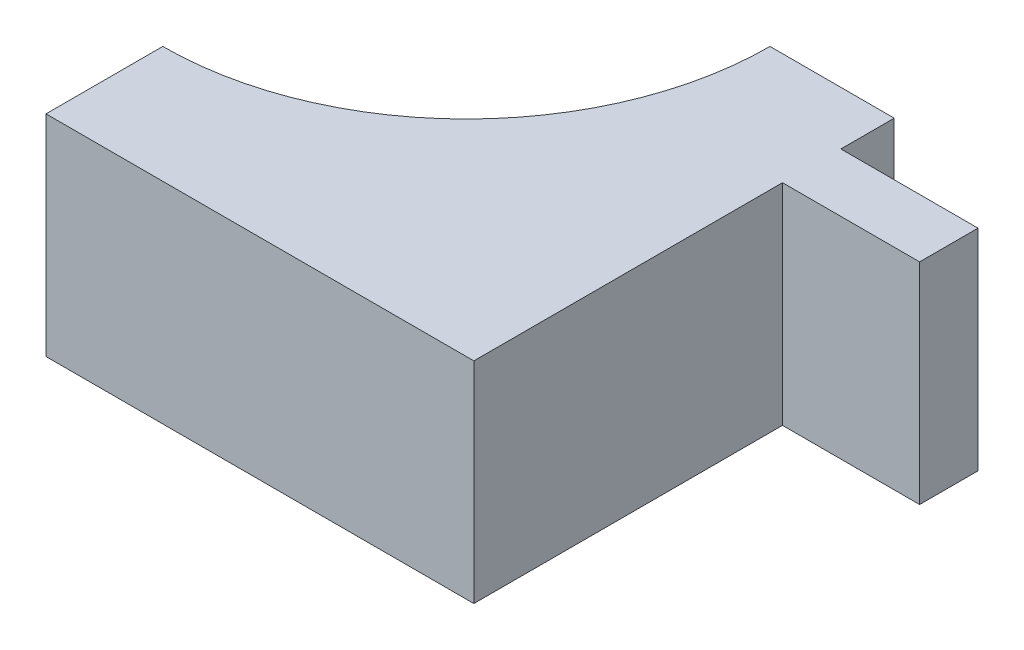
ISO-10303-21;
HEADER;
FILE_DESCRIPTION(('STEP AP214'),'2;1');
FILE_NAME('part.step','',(''),(''),'','','');
FILE_SCHEMA(('AUTOMOTIVE_DESIGN { 1 0 10303 214 1 1 1 1 }'));
ENDSEC;
DATA;
#1=APPLICATION_CONTEXT('core data for automotive mechanical design processes');
#2=APPLICATION_PROTOCOL_DEFINITION('international standard','automotive_design',2000,#1);
#3=PRODUCT_CONTEXT('',#1,'mechanical');
#4=PRODUCT('Part','Part','',(#3));
#5=PRODUCT_RELATED_PRODUCT_CATEGORY('part','',(#4));
#6=PRODUCT_DEFINITION_FORMATION('','',#4);
#7=PRODUCT_DEFINITION_CONTEXT('part definition',#1,'design');
#8=PRODUCT_DEFINITION('design','',#6,#7);
#9=PRODUCT_DEFINITION_SHAPE('','',#8);
#10=(LENGTH_UNIT() NAMED_UNIT(*) SI_UNIT(.MILLI.,.METRE.));
#11=(NAMED_UNIT(*) PLANE_ANGLE_UNIT() SI_UNIT($,.RADIAN.));
#12=(NAMED_UNIT(*) SI_UNIT($,.STERADIAN.) SOLID_ANGLE_UNIT());
#13=UNCERTAINTY_MEASURE_WITH_UNIT(LENGTH_MEASURE(1.E-05),#10,'distance_accuracy_value','');
#14=(GEOMETRIC_REPRESENTATION_CONTEXT(3) GLOBAL_UNCERTAINTY_ASSIGNED_CONTEXT((#13)) GLOBAL_UNIT_ASSIGNED_CONTEXT((#10,
#11,#12)) REPRESENTATION_CONTEXT('',''));
#15=CARTESIAN_POINT('',(0.,0.,0.));
#16=DIRECTION('',(0.,0.,1.));
#17=DIRECTION('',(1.,0.,0.));
#18=AXIS2_PLACEMENT_3D('',#15,#16,#17);
#19=CARTESIAN_POINT('',(-50.,18.,-305.));
#20=DIRECTION('',(0.,-1.,0.));
#21=DIRECTION('',(0.,0.,-1.));
#22=AXIS2_PLACEMENT_3D('',#19,#20,#21);
#23=CYLINDRICAL_SURFACE('',#22,26.);
#24=CARTESIAN_POINT('',(-50.,0.,-305.));
#25=DIRECTION('',(0.,-1.,0.));
#26=DIRECTION('',(0.,0.,1.));
#27=AXIS2_PLACEMENT_3D('',#24,#25,#26);
#28=CIRCLE('',#27,26.);
#29=CARTESIAN_POINT('',(-24.,0.,-305.));
#30=VERTEX_POINT('',#29);
#31=CARTESIAN_POINT('',(-50.,0.,-279.));
#32=VERTEX_POINT('',#31);
#33=EDGE_CURVE('E152',#30,#32,#28,.T.);
#34=ORIENTED_EDGE('',*,*,#33,.T.);
#35=DIRECTION('',(0.,-1.,0.));
#36=VECTOR('',#35,1.);
#37=CARTESIAN_POINT('',(-50.,18.,-279.));
#38=LINE('',#37,#36);
#39=CARTESIAN_POINT('',(-50.,18.,-279.));
#40=VERTEX_POINT('',#39);
#41=EDGE_CURVE('E11',#40,#32,#38,.T.);
#42=ORIENTED_EDGE('',*,*,#41,.F.);
#43=CARTESIAN_POINT('',(-50.,18.,-305.));
#44=DIRECTION('',(0.,-1.,0.));
#45=DIRECTION('',(0.,0.,1.));
#46=AXIS2_PLACEMENT_3D('',#43,#44,#45);
#47=CIRCLE('',#46,26.);
#48=CARTESIAN_POINT('',(-24.,18.,-305.));
#49=VERTEX_POINT('',#48);
#50=EDGE_CURVE('E177',#49,#40,#47,.T.);
#51=ORIENTED_EDGE('',*,*,#50,.F.);
#52=DIRECTION('',(0.,-1.,0.));
#53=VECTOR('',#52,1.);
#54=CARTESIAN_POINT('',(-24.,18.,-305.));
#55=LINE('',#54,#53);
#56=EDGE_CURVE('E148',#49,#30,#55,.T.);
#57=ORIENTED_EDGE('',*,*,#56,.T.);
#58=EDGE_LOOP('',(#34,#42,#51,#57));
#59=FACE_BOUND('',#58,.T.);
#60=ADVANCED_FACE('F45',(#59),#23,.F.);
#61=CARTESIAN_POINT('',(-50.,18.,-279.));
#62=DIRECTION('',(1.,0.,0.));
#63=DIRECTION('',(0.,0.,-1.));
#64=AXIS2_PLACEMENT_3D('',#61,#62,#63);
#65=PLANE('',#64);
#66=DIRECTION('',(0.,0.,1.));
#67=VECTOR('',#66,1.);
#68=CARTESIAN_POINT('',(-50.,0.,-279.));
#69=LINE('',#68,#67);
#70=CARTESIAN_POINT('',(-50.,0.,-269.));
#71=VERTEX_POINT('',#70);
#72=EDGE_CURVE('E156',#32,#71,#69,.T.);
#73=ORIENTED_EDGE('',*,*,#72,.T.);
#74=DIRECTION('',(0.,-1.,0.));
#75=VECTOR('',#74,1.);
#76=CARTESIAN_POINT('',(-50.,18.,-269.));
#77=LINE('',#76,#75);
#78=CARTESIAN_POINT('',(-50.,18.,-269.));
#79=VERTEX_POINT('',#78);
#80=EDGE_CURVE('E54',#79,#71,#77,.T.);
#81=ORIENTED_EDGE('',*,*,#80,.F.);
#82=DIRECTION('',(0.,0.,1.));
#83=VECTOR('',#82,1.);
#84=CARTESIAN_POINT('',(-50.,18.,-279.));
#85=LINE('',#84,#83);
#86=EDGE_CURVE('E108',#40,#79,#85,.T.);
#87=ORIENTED_EDGE('',*,*,#86,.F.);
#88=ORIENTED_EDGE('',*,*,#41,.T.);
#89=EDGE_LOOP('',(#73,#81,#87,#88));
#90=FACE_BOUND('',#89,.T.);
#91=ADVANCED_FACE('F233',(#90),#65,.F.);
#92=CARTESIAN_POINT('',(-50.,18.,-269.));
#93=DIRECTION('',(0.,0.,-1.));
#94=DIRECTION('',(-1.,0.,0.));
#95=AXIS2_PLACEMENT_3D('',#92,#93,#94);
#96=PLANE('',#95);
#97=DIRECTION('',(1.,0.,0.));
#98=VECTOR('',#97,1.);
#99=CARTESIAN_POINT('',(-50.,0.,-269.));
#100=LINE('',#99,#98);
#101=CARTESIAN_POINT('',(-13.36,0.,-269.));
#102=VERTEX_POINT('',#101);
#103=EDGE_CURVE('E159',#71,#102,#100,.T.);
#104=ORIENTED_EDGE('',*,*,#103,.T.);
#105=DIRECTION('',(0.,-1.,0.));
#106=VECTOR('',#105,1.);
#107=CARTESIAN_POINT('',(-13.36,18.,-269.));
#108=LINE('',#107,#106);
#109=CARTESIAN_POINT('',(-13.36,18.,-269.));
#110=VERTEX_POINT('',#109);
#111=EDGE_CURVE('E192',#110,#102,#108,.T.);
#112=ORIENTED_EDGE('',*,*,#111,.F.);
#113=DIRECTION('',(1.,0.,0.));
#114=VECTOR('',#113,1.);
#115=CARTESIAN_POINT('',(-50.,18.,-269.));
#116=LINE('',#115,#114);
#117=EDGE_CURVE('E202',#79,#110,#116,.T.);
#118=ORIENTED_EDGE('',*,*,#117,.F.);
#119=ORIENTED_EDGE('',*,*,#80,.T.);
#120=EDGE_LOOP('',(#104,#112,#118,#119));
#121=FACE_BOUND('',#120,.T.);
#122=ADVANCED_FACE('F200',(#121),#96,.F.);
#123=CARTESIAN_POINT('',(-13.36,18.,-269.));
#124=DIRECTION('',(-1.,0.,0.));
#125=DIRECTION('',(0.,0.,1.));
#126=AXIS2_PLACEMENT_3D('',#123,#124,#125);
#127=PLANE('',#126);
#128=DIRECTION('',(0.,0.,-1.));
#129=VECTOR('',#128,1.);
#130=CARTESIAN_POINT('',(-13.36,0.,-269.));
#131=LINE('',#130,#129);
#132=CARTESIAN_POINT('',(-13.36,0.,-295.43));
#133=VERTEX_POINT('',#132);
#134=EDGE_CURVE('E162',#102,#133,#131,.T.);
#135=ORIENTED_EDGE('',*,*,#134,.T.);
#136=DIRECTION('',(0.,-1.,0.));
#137=VECTOR('',#136,1.);
#138=CARTESIAN_POINT('',(-13.36,18.,-295.43));
#139=LINE('',#138,#137);
#140=CARTESIAN_POINT('',(-13.36,18.,-295.43));
#141=VERTEX_POINT('',#140);
#142=EDGE_CURVE('E188',#141,#133,#139,.T.);
#143=ORIENTED_EDGE('',*,*,#142,.F.);
#144=DIRECTION('',(0.,0.,-1.));
#145=VECTOR('',#144,1.);
#146=CARTESIAN_POINT('',(-13.36,18.,-269.));
#147=LINE('',#146,#145);
#148=EDGE_CURVE('E219',#110,#141,#147,.T.);
#149=ORIENTED_EDGE('',*,*,#148,.F.);
#150=ORIENTED_EDGE('',*,*,#111,.T.);
#151=EDGE_LOOP('',(#135,#143,#149,#150));
#152=FACE_BOUND('',#151,.T.);
#153=ADVANCED_FACE('F211',(#152),#127,.F.);
#154=CARTESIAN_POINT('',(-1.6160907324035,18.,-295.43));
#155=DIRECTION('',(0.,0.,-1.));
#156=DIRECTION('',(-1.,0.,0.));
#157=AXIS2_PLACEMENT_3D('',#154,#155,#156);
#158=PLANE('',#157);
#159=DIRECTION('',(1.,0.,0.));
#160=VECTOR('',#159,1.);
#161=CARTESIAN_POINT('',(-1.6160907324035,0.,-295.43));
#162=LINE('',#161,#160);
#163=CARTESIAN_POINT('',(-1.6160907324035,0.,-295.43));
#164=VERTEX_POINT('',#163);
#165=EDGE_CURVE('E165',#133,#164,#162,.T.);
#166=ORIENTED_EDGE('',*,*,#165,.T.);
#167=DIRECTION('',(0.,-1.,0.));
#168=VECTOR('',#167,1.);
#169=CARTESIAN_POINT('',(-1.6160907324035,18.,-295.43));
#170=LINE('',#169,#168);
#171=CARTESIAN_POINT('',(-1.6160907324035,18.,-295.43));
#172=VERTEX_POINT('',#171);
#173=EDGE_CURVE('E184',#172,#164,#170,.T.);
#174=ORIENTED_EDGE('',*,*,#173,.F.);
#175=DIRECTION('',(1.,0.,0.));
#176=VECTOR('',#175,1.);
#177=CARTESIAN_POINT('',(-1.6160907324035,18.,-295.43));
#178=LINE('',#177,#176);
#179=EDGE_CURVE('E217',#141,#172,#178,.T.);
#180=ORIENTED_EDGE('',*,*,#179,.F.);
#181=ORIENTED_EDGE('',*,*,#142,.T.);
#182=EDGE_LOOP('',(#166,#174,#180,#181));
#183=FACE_BOUND('',#182,.T.);
#184=ADVANCED_FACE('F215',(#183),#158,.F.);
#185=CARTESIAN_POINT('',(-1.6160907324035,18.,-300.43));
#186=DIRECTION('',(-1.,0.,0.));
#187=DIRECTION('',(0.,0.,1.));
#188=AXIS2_PLACEMENT_3D('',#185,#186,#187);
#189=PLANE('',#188);
#190=DIRECTION('',(0.,0.,-1.));
#191=VECTOR('',#190,1.);
#192=CARTESIAN_POINT('',(-1.6160907324035,0.,-300.43));
#193=LINE('',#192,#191);
#194=CARTESIAN_POINT('',(-1.6160907324035,0.,-300.43));
#195=VERTEX_POINT('',#194);
#196=EDGE_CURVE('E168',#164,#195,#193,.T.);
#197=ORIENTED_EDGE('',*,*,#196,.T.);
#198=DIRECTION('',(0.,-1.,0.));
#199=VECTOR('',#198,1.);
#200=CARTESIAN_POINT('',(-1.6160907324035,18.,-300.43));
#201=LINE('',#200,#199);
#202=CARTESIAN_POINT('',(-1.6160907324035,18.,-300.43));
#203=VERTEX_POINT('',#202);
#204=EDGE_CURVE('E141',#203,#195,#201,.T.);
#205=ORIENTED_EDGE('',*,*,#204,.F.);
#206=DIRECTION('',(0.,0.,-1.));
#207=VECTOR('',#206,1.);
#208=CARTESIAN_POINT('',(-1.6160907324035,18.,-300.43));
#209=LINE('',#208,#207);
#210=EDGE_CURVE('E130',#172,#203,#209,.T.);
#211=ORIENTED_EDGE('',*,*,#210,.F.);
#212=ORIENTED_EDGE('',*,*,#173,.T.);
#213=EDGE_LOOP('',(#197,#205,#211,#212));
#214=FACE_BOUND('',#213,.T.);
#215=ADVANCED_FACE('F245',(#214),#189,.F.);
#216=CARTESIAN_POINT('',(-13.36,18.,-300.43));
#217=DIRECTION('',(0.,0.,1.));
#218=DIRECTION('',(1.,0.,0.));
#219=AXIS2_PLACEMENT_3D('',#216,#217,#218);
#220=PLANE('',#219);
#221=DIRECTION('',(-1.,0.,0.));
#222=VECTOR('',#221,1.);
#223=CARTESIAN_POINT('',(-13.36,0.,-300.43));
#224=LINE('',#223,#222);
#225=CARTESIAN_POINT('',(-13.36,0.,-300.43));
#226=VERTEX_POINT('',#225);
#227=EDGE_CURVE('E139',#195,#226,#224,.T.);
#228=ORIENTED_EDGE('',*,*,#227,.T.);
#229=DIRECTION('',(0.,-1.,0.));
#230=VECTOR('',#229,1.);
#231=CARTESIAN_POINT('',(-13.36,18.,-300.43));
#232=LINE('',#231,#230);
#233=CARTESIAN_POINT('',(-13.36,18.,-300.43));
#234=VERTEX_POINT('',#233);
#235=EDGE_CURVE('E136',#234,#226,#232,.T.);
#236=ORIENTED_EDGE('',*,*,#235,.F.);
#237=DIRECTION('',(-1.,0.,0.));
#238=VECTOR('',#237,1.);
#239=CARTESIAN_POINT('',(-13.36,18.,-300.43));
#240=LINE('',#239,#238);
#241=EDGE_CURVE('E124',#203,#234,#240,.T.);
#242=ORIENTED_EDGE('',*,*,#241,.F.);
#243=ORIENTED_EDGE('',*,*,#204,.T.);
#244=EDGE_LOOP('',(#228,#236,#242,#243));
#245=FACE_BOUND('',#244,.T.);
#246=ADVANCED_FACE('F137',(#245),#220,.F.);
#247=CARTESIAN_POINT('',(-13.36,18.,-300.43));
#248=DIRECTION('',(-1.,0.,0.));
#249=DIRECTION('',(0.,0.,1.));
#250=AXIS2_PLACEMENT_3D('',#247,#248,#249);
#251=PLANE('',#250);
#252=DIRECTION('',(0.,0.,-1.));
#253=VECTOR('',#252,1.);
#254=CARTESIAN_POINT('',(-13.36,0.,-300.43));
#255=LINE('',#254,#253);
#256=CARTESIAN_POINT('',(-13.36,0.,-305.));
#257=VERTEX_POINT('',#256);
#258=EDGE_CURVE('E94',#226,#257,#255,.T.);
#259=ORIENTED_EDGE('',*,*,#258,.T.);
#260=DIRECTION('',(0.,-1.,0.));
#261=VECTOR('',#260,1.);
#262=CARTESIAN_POINT('',(-13.36,18.,-305.));
#263=LINE('',#262,#261);
#264=CARTESIAN_POINT('',(-13.36,18.,-305.));
#265=VERTEX_POINT('',#264);
#266=EDGE_CURVE('E142',#265,#257,#263,.T.);
#267=ORIENTED_EDGE('',*,*,#266,.F.);
#268=DIRECTION('',(0.,0.,-1.));
#269=VECTOR('',#268,1.);
#270=CARTESIAN_POINT('',(-13.36,18.,-300.43));
#271=LINE('',#270,#269);
#272=EDGE_CURVE('E128',#234,#265,#271,.T.);
#273=ORIENTED_EDGE('',*,*,#272,.F.);
#274=ORIENTED_EDGE('',*,*,#235,.T.);
#275=EDGE_LOOP('',(#259,#267,#273,#274));
#276=FACE_BOUND('',#275,.T.);
#277=ADVANCED_FACE('F144',(#276),#251,.F.);
#278=CARTESIAN_POINT('',(-24.,18.,-305.));
#279=DIRECTION('',(0.,0.,1.));
#280=DIRECTION('',(1.,0.,0.));
#281=AXIS2_PLACEMENT_3D('',#278,#279,#280);
#282=PLANE('',#281);
#283=DIRECTION('',(-1.,0.,0.));
#284=VECTOR('',#283,1.);
#285=CARTESIAN_POINT('',(-24.,0.,-305.));
#286=LINE('',#285,#284);
#287=EDGE_CURVE('E100',#257,#30,#286,.T.);
#288=ORIENTED_EDGE('',*,*,#287,.T.);
#289=ORIENTED_EDGE('',*,*,#56,.F.);
#290=DIRECTION('',(-1.,0.,0.));
#291=VECTOR('',#290,1.);
#292=CARTESIAN_POINT('',(-24.,18.,-305.));
#293=LINE('',#292,#291);
#294=EDGE_CURVE('E62',#265,#49,#293,.T.);
#295=ORIENTED_EDGE('',*,*,#294,.F.);
#296=ORIENTED_EDGE('',*,*,#266,.T.);
#297=EDGE_LOOP('',(#288,#289,#295,#296));
#298=FACE_BOUND('',#297,.T.);
#299=ADVANCED_FACE('F253',(#298),#282,.F.);
#300=CARTESIAN_POINT('',(-50.,18.,-305.));
#301=DIRECTION('',(0.,1.,0.));
#302=DIRECTION('',(0.,0.,1.));
#303=AXIS2_PLACEMENT_3D('',#300,#301,#302);
#304=PLANE('',#303);
#305=ORIENTED_EDGE('',*,*,#50,.T.);
#306=ORIENTED_EDGE('',*,*,#86,.T.);
#307=ORIENTED_EDGE('',*,*,#117,.T.);
#308=ORIENTED_EDGE('',*,*,#148,.T.);
#309=ORIENTED_EDGE('',*,*,#179,.T.);
#310=ORIENTED_EDGE('',*,*,#210,.T.);
#311=ORIENTED_EDGE('',*,*,#241,.T.);
#312=ORIENTED_EDGE('',*,*,#272,.T.);
#313=ORIENTED_EDGE('',*,*,#294,.T.);
#314=EDGE_LOOP('',(#305,#306,#307,#308,#309,#310,#311,#312,#313));
#315=FACE_BOUND('',#314,.T.);
#316=ADVANCED_FACE('F126',(#315),#304,.T.);
#317=CARTESIAN_POINT('',(-50.,0.,-305.));
#318=DIRECTION('',(0.,1.,0.));
#319=DIRECTION('',(0.,0.,1.));
#320=AXIS2_PLACEMENT_3D('',#317,#318,#319);
#321=PLANE('',#320);
#322=ORIENTED_EDGE('',*,*,#33,.F.);
#323=ORIENTED_EDGE('',*,*,#287,.F.);
#324=ORIENTED_EDGE('',*,*,#258,.F.);
#325=ORIENTED_EDGE('',*,*,#227,.F.);
#326=ORIENTED_EDGE('',*,*,#196,.F.);
#327=ORIENTED_EDGE('',*,*,#165,.F.);
#328=ORIENTED_EDGE('',*,*,#134,.F.);
#329=ORIENTED_EDGE('',*,*,#103,.F.);
#330=ORIENTED_EDGE('',*,*,#72,.F.);
#331=EDGE_LOOP('',(#322,#323,#324,#325,#326,#327,#328,#329,#330));
#332=FACE_BOUND('',#331,.T.);
#333=ADVANCED_FACE('F206',(#332),#321,.F.);
#334=CLOSED_SHELL('',(#60,#91,#122,#153,#184,#215,#246,#277,#299,#316,#333));
#335=MANIFOLD_SOLID_BREP('B2',#334);
#336=ADVANCED_BREP_SHAPE_REPRESENTATION('',(#18,#335),#14);
#337=SHAPE_DEFINITION_REPRESENTATION(#9,#336);
ENDSEC;
END-ISO-10303-21;
